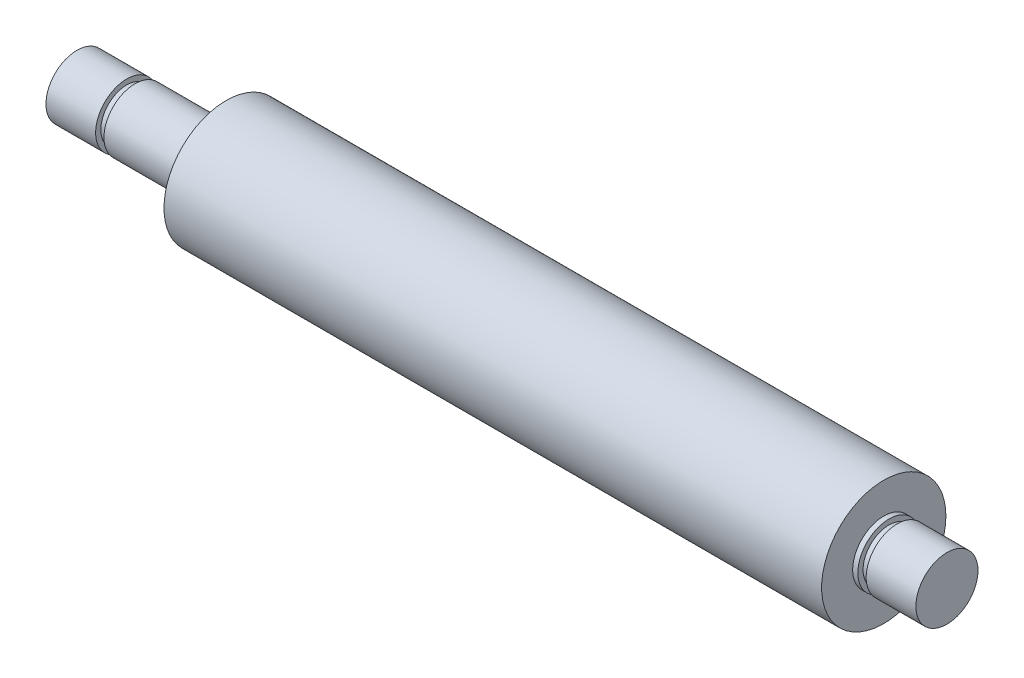
ISO-10303-21;
HEADER;
FILE_DESCRIPTION(('STEP AP214'),'2;1');
FILE_NAME('part.step','',(''),(''),'','','');
FILE_SCHEMA(('AUTOMOTIVE_DESIGN { 1 0 10303 214 1 1 1 1 }'));
ENDSEC;
DATA;
#1=APPLICATION_CONTEXT('core data for automotive mechanical design processes');
#2=APPLICATION_PROTOCOL_DEFINITION('international standard','automotive_design',2000,#1);
#3=PRODUCT_CONTEXT('',#1,'mechanical');
#4=PRODUCT('Part','Part','',(#3));
#5=PRODUCT_RELATED_PRODUCT_CATEGORY('part','',(#4));
#6=PRODUCT_DEFINITION_FORMATION('','',#4);
#7=PRODUCT_DEFINITION_CONTEXT('part definition',#1,'design');
#8=PRODUCT_DEFINITION('design','',#6,#7);
#9=PRODUCT_DEFINITION_SHAPE('','',#8);
#10=(LENGTH_UNIT() NAMED_UNIT(*) SI_UNIT(.MILLI.,.METRE.));
#11=(NAMED_UNIT(*) PLANE_ANGLE_UNIT() SI_UNIT($,.RADIAN.));
#12=(NAMED_UNIT(*) SI_UNIT($,.STERADIAN.) SOLID_ANGLE_UNIT());
#13=UNCERTAINTY_MEASURE_WITH_UNIT(LENGTH_MEASURE(1.E-05),#10,'distance_accuracy_value','');
#14=(GEOMETRIC_REPRESENTATION_CONTEXT(3) GLOBAL_UNCERTAINTY_ASSIGNED_CONTEXT((#13)) GLOBAL_UNIT_ASSIGNED_CONTEXT((#10,
#11,#12)) REPRESENTATION_CONTEXT('',''));
#15=CARTESIAN_POINT('',(0.,0.,0.));
#16=DIRECTION('',(0.,0.,1.));
#17=DIRECTION('',(1.,0.,0.));
#18=AXIS2_PLACEMENT_3D('',#15,#16,#17);
#19=CARTESIAN_POINT('',(-42.,0.,0.));
#20=DIRECTION('',(1.,0.,0.));
#21=DIRECTION('',(0.,0.,-1.));
#22=AXIS2_PLACEMENT_3D('',#19,#20,#21);
#23=CYLINDRICAL_SURFACE('',#22,3.);
#24=CARTESIAN_POINT('',(-42.,0.,0.));
#25=DIRECTION('',(1.,0.,0.));
#26=DIRECTION('',(0.,0.,-1.));
#27=AXIS2_PLACEMENT_3D('',#24,#25,#26);
#28=CIRCLE('',#27,3.);
#29=CARTESIAN_POINT('',(-42.,0.,-3.));
#30=VERTEX_POINT('',#29);
#31=EDGE_CURVE('E10',#30,#30,#28,.T.);
#32=ORIENTED_EDGE('',*,*,#31,.T.);
#33=EDGE_LOOP('',(#32));
#34=FACE_BOUND('',#33,.T.);
#35=CARTESIAN_POINT('',(-37.2,0.,0.));
#36=DIRECTION('',(1.,0.,0.));
#37=DIRECTION('',(0.,0.,-1.));
#38=AXIS2_PLACEMENT_3D('',#35,#36,#37);
#39=CIRCLE('',#38,3.);
#40=CARTESIAN_POINT('',(-37.2,0.,-3.));
#41=VERTEX_POINT('',#40);
#42=EDGE_CURVE('E76',#41,#41,#39,.T.);
#43=ORIENTED_EDGE('',*,*,#42,.F.);
#44=EDGE_LOOP('',(#43));
#45=FACE_BOUND('',#44,.T.);
#46=ADVANCED_FACE('F30',(#34,#45),#23,.T.);
#47=CARTESIAN_POINT('',(-42.,3.,0.));
#48=DIRECTION('',(-1.,0.,0.));
#49=DIRECTION('',(0.,0.,1.));
#50=AXIS2_PLACEMENT_3D('',#47,#48,#49);
#51=PLANE('',#50);
#52=ORIENTED_EDGE('',*,*,#31,.F.);
#53=EDGE_LOOP('',(#52));
#54=FACE_BOUND('',#53,.T.);
#55=ADVANCED_FACE('F84',(#54),#51,.T.);
#56=CARTESIAN_POINT('',(42.,0.,0.));
#57=DIRECTION('',(1.,0.,0.));
#58=DIRECTION('',(0.,0.,-1.));
#59=AXIS2_PLACEMENT_3D('',#56,#57,#58);
#60=PLANE('',#59);
#61=CARTESIAN_POINT('',(42.,0.,0.));
#62=DIRECTION('',(1.,0.,0.));
#63=DIRECTION('',(0.,0.,-1.));
#64=AXIS2_PLACEMENT_3D('',#61,#62,#63);
#65=CIRCLE('',#64,3.);
#66=CARTESIAN_POINT('',(42.,0.,-3.));
#67=VERTEX_POINT('',#66);
#68=EDGE_CURVE('E36',#67,#67,#65,.T.);
#69=ORIENTED_EDGE('',*,*,#68,.T.);
#70=EDGE_LOOP('',(#69));
#71=FACE_BOUND('',#70,.T.);
#72=ADVANCED_FACE('F88',(#71),#60,.T.);
#73=CARTESIAN_POINT('',(-42.,0.,0.));
#74=DIRECTION('',(1.,0.,0.));
#75=DIRECTION('',(0.,0.,-1.));
#76=AXIS2_PLACEMENT_3D('',#73,#74,#75);
#77=CYLINDRICAL_SURFACE('',#76,3.);
#78=CARTESIAN_POINT('',(37.2,0.,0.));
#79=DIRECTION('',(1.,0.,0.));
#80=DIRECTION('',(0.,0.,-1.));
#81=AXIS2_PLACEMENT_3D('',#78,#79,#80);
#82=CIRCLE('',#81,3.);
#83=CARTESIAN_POINT('',(37.2,0.,-3.));
#84=VERTEX_POINT('',#83);
#85=EDGE_CURVE('E40',#84,#84,#82,.T.);
#86=ORIENTED_EDGE('',*,*,#85,.T.);
#87=EDGE_LOOP('',(#86));
#88=FACE_BOUND('',#87,.T.);
#89=ORIENTED_EDGE('',*,*,#68,.F.);
#90=EDGE_LOOP('',(#89));
#91=FACE_BOUND('',#90,.T.);
#92=ADVANCED_FACE('F93',(#88,#91),#77,.T.);
#93=CARTESIAN_POINT('',(37.2,3.,0.));
#94=DIRECTION('',(-1.,0.,0.));
#95=DIRECTION('',(0.,0.,1.));
#96=AXIS2_PLACEMENT_3D('',#93,#94,#95);
#97=PLANE('',#96);
#98=CARTESIAN_POINT('',(37.2,0.,0.));
#99=DIRECTION('',(1.,0.,0.));
#100=DIRECTION('',(0.,0.,-1.));
#101=AXIS2_PLACEMENT_3D('',#98,#99,#100);
#102=CIRCLE('',#101,2.5);
#103=CARTESIAN_POINT('',(37.2,0.,-2.5));
#104=VERTEX_POINT('',#103);
#105=EDGE_CURVE('E44',#104,#104,#102,.T.);
#106=ORIENTED_EDGE('',*,*,#105,.T.);
#107=EDGE_LOOP('',(#106));
#108=FACE_BOUND('',#107,.T.);
#109=ORIENTED_EDGE('',*,*,#85,.F.);
#110=EDGE_LOOP('',(#109));
#111=FACE_BOUND('',#110,.T.);
#112=ADVANCED_FACE('F98',(#108,#111),#97,.T.);
#113=CARTESIAN_POINT('',(-42.,0.,0.));
#114=DIRECTION('',(1.,0.,0.));
#115=DIRECTION('',(0.,0.,-1.));
#116=AXIS2_PLACEMENT_3D('',#113,#114,#115);
#117=CYLINDRICAL_SURFACE('',#116,2.5);
#118=CARTESIAN_POINT('',(36.4,0.,0.));
#119=DIRECTION('',(1.,0.,0.));
#120=DIRECTION('',(0.,0.,-1.));
#121=AXIS2_PLACEMENT_3D('',#118,#119,#120);
#122=CIRCLE('',#121,2.5);
#123=CARTESIAN_POINT('',(36.4,0.,-2.5));
#124=VERTEX_POINT('',#123);
#125=EDGE_CURVE('E49',#124,#124,#122,.T.);
#126=ORIENTED_EDGE('',*,*,#125,.T.);
#127=EDGE_LOOP('',(#126));
#128=FACE_BOUND('',#127,.T.);
#129=ORIENTED_EDGE('',*,*,#105,.F.);
#130=EDGE_LOOP('',(#129));
#131=FACE_BOUND('',#130,.T.);
#132=ADVANCED_FACE('F102',(#128,#131),#117,.T.);
#133=CARTESIAN_POINT('',(36.4,2.5,0.));
#134=DIRECTION('',(1.,0.,0.));
#135=DIRECTION('',(0.,0.,-1.));
#136=AXIS2_PLACEMENT_3D('',#133,#134,#135);
#137=PLANE('',#136);
#138=CARTESIAN_POINT('',(36.4,0.,0.));
#139=DIRECTION('',(1.,0.,0.));
#140=DIRECTION('',(0.,0.,-1.));
#141=AXIS2_PLACEMENT_3D('',#138,#139,#140);
#142=CIRCLE('',#141,3.);
#143=CARTESIAN_POINT('',(36.4,0.,-3.));
#144=VERTEX_POINT('',#143);
#145=EDGE_CURVE('E52',#144,#144,#142,.T.);
#146=ORIENTED_EDGE('',*,*,#145,.T.);
#147=EDGE_LOOP('',(#146));
#148=FACE_BOUND('',#147,.T.);
#149=ORIENTED_EDGE('',*,*,#125,.F.);
#150=EDGE_LOOP('',(#149));
#151=FACE_BOUND('',#150,.T.);
#152=ADVANCED_FACE('F106',(#148,#151),#137,.T.);
#153=CARTESIAN_POINT('',(-42.,0.,0.));
#154=DIRECTION('',(1.,0.,0.));
#155=DIRECTION('',(0.,0.,-1.));
#156=AXIS2_PLACEMENT_3D('',#153,#154,#155);
#157=CYLINDRICAL_SURFACE('',#156,3.);
#158=CARTESIAN_POINT('',(35.9,0.,0.));
#159=DIRECTION('',(1.,0.,0.));
#160=DIRECTION('',(0.,0.,-1.));
#161=AXIS2_PLACEMENT_3D('',#158,#159,#160);
#162=CIRCLE('',#161,3.);
#163=CARTESIAN_POINT('',(35.9,0.,-3.));
#164=VERTEX_POINT('',#163);
#165=EDGE_CURVE('E55',#164,#164,#162,.T.);
#166=ORIENTED_EDGE('',*,*,#165,.T.);
#167=EDGE_LOOP('',(#166));
#168=FACE_BOUND('',#167,.T.);
#169=ORIENTED_EDGE('',*,*,#145,.F.);
#170=EDGE_LOOP('',(#169));
#171=FACE_BOUND('',#170,.T.);
#172=ADVANCED_FACE('F110',(#168,#171),#157,.T.);
#173=CARTESIAN_POINT('',(35.9,3.,0.));
#174=DIRECTION('',(1.,0.,0.));
#175=DIRECTION('',(0.,0.,-1.));
#176=AXIS2_PLACEMENT_3D('',#173,#174,#175);
#177=PLANE('',#176);
#178=CARTESIAN_POINT('',(35.9,0.,0.));
#179=DIRECTION('',(1.,0.,0.));
#180=DIRECTION('',(0.,0.,-1.));
#181=AXIS2_PLACEMENT_3D('',#178,#179,#180);
#182=CIRCLE('',#181,6.);
#183=CARTESIAN_POINT('',(35.9,0.,-6.));
#184=VERTEX_POINT('',#183);
#185=EDGE_CURVE('E58',#184,#184,#182,.T.);
#186=ORIENTED_EDGE('',*,*,#185,.T.);
#187=EDGE_LOOP('',(#186));
#188=FACE_BOUND('',#187,.T.);
#189=ORIENTED_EDGE('',*,*,#165,.F.);
#190=EDGE_LOOP('',(#189));
#191=FACE_BOUND('',#190,.T.);
#192=ADVANCED_FACE('F114',(#188,#191),#177,.T.);
#193=CARTESIAN_POINT('',(-42.,0.,0.));
#194=DIRECTION('',(1.,0.,0.));
#195=DIRECTION('',(0.,0.,-1.));
#196=AXIS2_PLACEMENT_3D('',#193,#194,#195);
#197=CYLINDRICAL_SURFACE('',#196,6.);
#198=CARTESIAN_POINT('',(-27.6,0.,0.));
#199=DIRECTION('',(1.,0.,0.));
#200=DIRECTION('',(0.,0.,-1.));
#201=AXIS2_PLACEMENT_3D('',#198,#199,#200);
#202=CIRCLE('',#201,6.);
#203=CARTESIAN_POINT('',(-27.6,0.,-6.));
#204=VERTEX_POINT('',#203);
#205=EDGE_CURVE('E61',#204,#204,#202,.T.);
#206=ORIENTED_EDGE('',*,*,#205,.T.);
#207=EDGE_LOOP('',(#206));
#208=FACE_BOUND('',#207,.T.);
#209=ORIENTED_EDGE('',*,*,#185,.F.);
#210=EDGE_LOOP('',(#209));
#211=FACE_BOUND('',#210,.T.);
#212=ADVANCED_FACE('F118',(#208,#211),#197,.T.);
#213=CARTESIAN_POINT('',(-27.6,6.,0.));
#214=DIRECTION('',(-1.,0.,0.));
#215=DIRECTION('',(0.,0.,1.));
#216=AXIS2_PLACEMENT_3D('',#213,#214,#215);
#217=PLANE('',#216);
#218=CARTESIAN_POINT('',(-27.6,0.,0.));
#219=DIRECTION('',(1.,0.,0.));
#220=DIRECTION('',(0.,0.,-1.));
#221=AXIS2_PLACEMENT_3D('',#218,#219,#220);
#222=CIRCLE('',#221,3.);
#223=CARTESIAN_POINT('',(-27.6,0.,-3.));
#224=VERTEX_POINT('',#223);
#225=EDGE_CURVE('E64',#224,#224,#222,.T.);
#226=ORIENTED_EDGE('',*,*,#225,.T.);
#227=EDGE_LOOP('',(#226));
#228=FACE_BOUND('',#227,.T.);
#229=ORIENTED_EDGE('',*,*,#205,.F.);
#230=EDGE_LOOP('',(#229));
#231=FACE_BOUND('',#230,.T.);
#232=ADVANCED_FACE('F122',(#228,#231),#217,.T.);
#233=CARTESIAN_POINT('',(-42.,0.,0.));
#234=DIRECTION('',(1.,0.,0.));
#235=DIRECTION('',(0.,0.,-1.));
#236=AXIS2_PLACEMENT_3D('',#233,#234,#235);
#237=CYLINDRICAL_SURFACE('',#236,3.);
#238=CARTESIAN_POINT('',(-36.4,0.,0.));
#239=DIRECTION('',(1.,0.,0.));
#240=DIRECTION('',(0.,0.,-1.));
#241=AXIS2_PLACEMENT_3D('',#238,#239,#240);
#242=CIRCLE('',#241,3.);
#243=CARTESIAN_POINT('',(-36.4,0.,-3.));
#244=VERTEX_POINT('',#243);
#245=EDGE_CURVE('E67',#244,#244,#242,.T.);
#246=ORIENTED_EDGE('',*,*,#245,.T.);
#247=EDGE_LOOP('',(#246));
#248=FACE_BOUND('',#247,.T.);
#249=ORIENTED_EDGE('',*,*,#225,.F.);
#250=EDGE_LOOP('',(#249));
#251=FACE_BOUND('',#250,.T.);
#252=ADVANCED_FACE('F126',(#248,#251),#237,.T.);
#253=CARTESIAN_POINT('',(-36.4,3.,0.));
#254=DIRECTION('',(-1.,0.,0.));
#255=DIRECTION('',(0.,0.,1.));
#256=AXIS2_PLACEMENT_3D('',#253,#254,#255);
#257=PLANE('',#256);
#258=CARTESIAN_POINT('',(-36.4,0.,0.));
#259=DIRECTION('',(1.,0.,0.));
#260=DIRECTION('',(0.,0.,-1.));
#261=AXIS2_PLACEMENT_3D('',#258,#259,#260);
#262=CIRCLE('',#261,2.5);
#263=CARTESIAN_POINT('',(-36.4,0.,-2.5));
#264=VERTEX_POINT('',#263);
#265=EDGE_CURVE('E70',#264,#264,#262,.T.);
#266=ORIENTED_EDGE('',*,*,#265,.T.);
#267=EDGE_LOOP('',(#266));
#268=FACE_BOUND('',#267,.T.);
#269=ORIENTED_EDGE('',*,*,#245,.F.);
#270=EDGE_LOOP('',(#269));
#271=FACE_BOUND('',#270,.T.);
#272=ADVANCED_FACE('F130',(#268,#271),#257,.T.);
#273=CARTESIAN_POINT('',(-42.,0.,0.));
#274=DIRECTION('',(1.,0.,0.));
#275=DIRECTION('',(0.,0.,-1.));
#276=AXIS2_PLACEMENT_3D('',#273,#274,#275);
#277=CYLINDRICAL_SURFACE('',#276,2.5);
#278=CARTESIAN_POINT('',(-37.2,0.,0.));
#279=DIRECTION('',(1.,0.,0.));
#280=DIRECTION('',(0.,0.,-1.));
#281=AXIS2_PLACEMENT_3D('',#278,#279,#280);
#282=CIRCLE('',#281,2.5);
#283=CARTESIAN_POINT('',(-37.2,0.,-2.5));
#284=VERTEX_POINT('',#283);
#285=EDGE_CURVE('E73',#284,#284,#282,.T.);
#286=ORIENTED_EDGE('',*,*,#285,.T.);
#287=EDGE_LOOP('',(#286));
#288=FACE_BOUND('',#287,.T.);
#289=ORIENTED_EDGE('',*,*,#265,.F.);
#290=EDGE_LOOP('',(#289));
#291=FACE_BOUND('',#290,.T.);
#292=ADVANCED_FACE('F134',(#288,#291),#277,.T.);
#293=CARTESIAN_POINT('',(-37.2,2.5,0.));
#294=DIRECTION('',(1.,0.,0.));
#295=DIRECTION('',(0.,0.,-1.));
#296=AXIS2_PLACEMENT_3D('',#293,#294,#295);
#297=PLANE('',#296);
#298=ORIENTED_EDGE('',*,*,#42,.T.);
#299=EDGE_LOOP('',(#298));
#300=FACE_BOUND('',#299,.T.);
#301=ORIENTED_EDGE('',*,*,#285,.F.);
#302=EDGE_LOOP('',(#301));
#303=FACE_BOUND('',#302,.T.);
#304=ADVANCED_FACE('F80',(#300,#303),#297,.T.);
#305=CLOSED_SHELL('',(#46,#55,#72,#92,#112,#132,#152,#172,#192,#212,#232,#252,#272,#292,#304));
#306=MANIFOLD_SOLID_BREP('B2',#305);
#307=ADVANCED_BREP_SHAPE_REPRESENTATION('',(#18,#306),#14);
#308=SHAPE_DEFINITION_REPRESENTATION(#9,#307);
ENDSEC;
END-ISO-10303-21;
